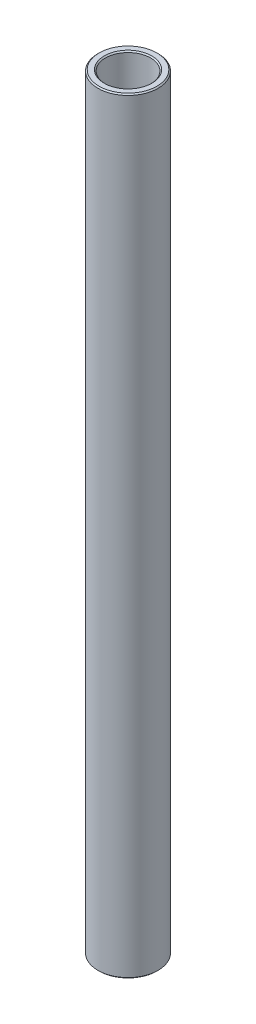
ISO-10303-21;
HEADER;
FILE_DESCRIPTION(('STEP AP214'),'2;1');
FILE_NAME('part.step','',(''),(''),'','','');
FILE_SCHEMA(('AUTOMOTIVE_DESIGN { 1 0 10303 214 1 1 1 1 }'));
ENDSEC;
DATA;
#1=APPLICATION_CONTEXT('core data for automotive mechanical design processes');
#2=APPLICATION_PROTOCOL_DEFINITION('international standard','automotive_design',2000,#1);
#3=PRODUCT_CONTEXT('',#1,'mechanical');
#4=PRODUCT('Part','Part','',(#3));
#5=PRODUCT_RELATED_PRODUCT_CATEGORY('part','',(#4));
#6=PRODUCT_DEFINITION_FORMATION('','',#4);
#7=PRODUCT_DEFINITION_CONTEXT('part definition',#1,'design');
#8=PRODUCT_DEFINITION('design','',#6,#7);
#9=PRODUCT_DEFINITION_SHAPE('','',#8);
#10=(LENGTH_UNIT() NAMED_UNIT(*) SI_UNIT(.MILLI.,.METRE.));
#11=(NAMED_UNIT(*) PLANE_ANGLE_UNIT() SI_UNIT($,.RADIAN.));
#12=(NAMED_UNIT(*) SI_UNIT($,.STERADIAN.) SOLID_ANGLE_UNIT());
#13=UNCERTAINTY_MEASURE_WITH_UNIT(LENGTH_MEASURE(1.E-05),#10,'distance_accuracy_value','');
#14=(GEOMETRIC_REPRESENTATION_CONTEXT(3) GLOBAL_UNCERTAINTY_ASSIGNED_CONTEXT((#13)) GLOBAL_UNIT_ASSIGNED_CONTEXT((#10,
#11,#12)) REPRESENTATION_CONTEXT('',''));
#15=CARTESIAN_POINT('',(0.,0.,0.));
#16=DIRECTION('',(0.,0.,1.));
#17=DIRECTION('',(1.,0.,0.));
#18=AXIS2_PLACEMENT_3D('',#15,#16,#17);
#19=CARTESIAN_POINT('',(6.3500000000003,70.6436949648141,0.));
#20=DIRECTION('',(0.,-1.,0.));
#21=DIRECTION('',(1.,0.,0.));
#22=AXIS2_PLACEMENT_3D('',#19,#20,#21);
#23=PLANE('',#22);
#24=CARTESIAN_POINT('',(1.6889982990843E-13,70.6436949648142,0.));
#25=DIRECTION('',(0.,-1.,0.));
#26=DIRECTION('',(1.,0.,0.));
#27=AXIS2_PLACEMENT_3D('',#24,#25,#26);
#28=CIRCLE('',#27,5.01649999999979);
#29=CARTESIAN_POINT('',(5.01649999999996,70.6436949648141,0.));
#30=VERTEX_POINT('',#29);
#31=EDGE_CURVE('E10',#30,#30,#28,.F.);
#32=ORIENTED_EDGE('',*,*,#31,.T.);
#33=EDGE_LOOP('',(#32));
#34=FACE_BOUND('',#33,.T.);
#35=CARTESIAN_POINT('',(1.6889982990843E-13,70.6436949648142,0.));
#36=DIRECTION('',(0.,-1.,0.));
#37=DIRECTION('',(1.,0.,0.));
#38=AXIS2_PLACEMENT_3D('',#35,#36,#37);
#39=CIRCLE('',#38,6.09600000000013);
#40=CARTESIAN_POINT('',(6.0960000000003,70.6436949648141,0.));
#41=VERTEX_POINT('',#40);
#42=EDGE_CURVE('E38',#41,#41,#39,.T.);
#43=ORIENTED_EDGE('',*,*,#42,.T.);
#44=EDGE_LOOP('',(#43));
#45=FACE_BOUND('',#44,.T.);
#46=ADVANCED_FACE('F31',(#34,#45),#23,.T.);
#47=CARTESIAN_POINT('',(0.,61.1186949648141,0.));
#48=DIRECTION('',(0.,-1.,0.));
#49=DIRECTION('',(1.,0.,0.));
#50=AXIS2_PLACEMENT_3D('',#47,#48,#49);
#51=CYLINDRICAL_SURFACE('',#50,4.76249999999841);
#52=CARTESIAN_POINT('',(3.03236515823251E-12,232.127026635866,0.));
#53=DIRECTION('',(0.,1.,0.));
#54=DIRECTION('',(-1.,0.,0.));
#55=AXIS2_PLACEMENT_3D('',#52,#53,#54);
#56=CIRCLE('',#55,4.76249999999841);
#57=CARTESIAN_POINT('',(-4.76249999999538,232.127026635866,0.));
#58=VERTEX_POINT('',#57);
#59=EDGE_CURVE('E42',#58,#58,#56,.T.);
#60=ORIENTED_EDGE('',*,*,#59,.T.);
#61=EDGE_LOOP('',(#60));
#62=FACE_BOUND('',#61,.T.);
#63=CARTESIAN_POINT('',(1.73403825372679E-13,70.8976949648156,0.));
#64=DIRECTION('',(0.,-1.,0.));
#65=DIRECTION('',(1.,0.,0.));
#66=AXIS2_PLACEMENT_3D('',#63,#64,#65);
#67=CIRCLE('',#66,4.76249999999841);
#68=CARTESIAN_POINT('',(4.76249999999858,70.8976949648155,0.));
#69=VERTEX_POINT('',#68);
#70=EDGE_CURVE('E46',#69,#69,#67,.T.);
#71=ORIENTED_EDGE('',*,*,#70,.T.);
#72=EDGE_LOOP('',(#71));
#73=FACE_BOUND('',#72,.T.);
#74=ADVANCED_FACE('F75',(#62,#73),#51,.F.);
#75=CARTESIAN_POINT('',(4.76250000000001,232.381026635865,0.));
#76=DIRECTION('',(0.,1.,0.));
#77=DIRECTION('',(-1.,0.,0.));
#78=AXIS2_PLACEMENT_3D('',#75,#76,#77);
#79=PLANE('',#78);
#80=CARTESIAN_POINT('',(3.03686915369671E-12,232.381026635865,0.));
#81=DIRECTION('',(0.,1.,0.));
#82=DIRECTION('',(-1.,0.,0.));
#83=AXIS2_PLACEMENT_3D('',#80,#81,#82);
#84=CIRCLE('',#83,6.09599999999719);
#85=CARTESIAN_POINT('',(-6.09599999999416,232.381026635865,0.));
#86=VERTEX_POINT('',#85);
#87=EDGE_CURVE('E51',#86,#86,#84,.T.);
#88=ORIENTED_EDGE('',*,*,#87,.T.);
#89=EDGE_LOOP('',(#88));
#90=FACE_BOUND('',#89,.T.);
#91=CARTESIAN_POINT('',(3.03686915369671E-12,232.381026635865,0.));
#92=DIRECTION('',(0.,1.,0.));
#93=DIRECTION('',(-1.,0.,0.));
#94=AXIS2_PLACEMENT_3D('',#91,#92,#93);
#95=CIRCLE('',#94,5.01649999999698);
#96=CARTESIAN_POINT('',(-5.01649999999394,232.381026635865,0.));
#97=VERTEX_POINT('',#96);
#98=EDGE_CURVE('E54',#97,#97,#95,.F.);
#99=ORIENTED_EDGE('',*,*,#98,.T.);
#100=EDGE_LOOP('',(#99));
#101=FACE_BOUND('',#100,.T.);
#102=ADVANCED_FACE('F80',(#90,#101),#79,.T.);
#103=CARTESIAN_POINT('',(0.,61.1186949648141,0.));
#104=DIRECTION('',(0.,-1.,0.));
#105=DIRECTION('',(1.,0.,0.));
#106=AXIS2_PLACEMENT_3D('',#103,#104,#105);
#107=CYLINDRICAL_SURFACE('',#106,6.34999999999869);
#108=CARTESIAN_POINT('',(3.03236515823246E-12,232.127026635863,0.));
#109=DIRECTION('',(0.,1.,0.));
#110=DIRECTION('',(-1.,0.,0.));
#111=AXIS2_PLACEMENT_3D('',#108,#109,#110);
#112=CIRCLE('',#111,6.34999999999869);
#113=CARTESIAN_POINT('',(-6.34999999999565,232.127026635863,0.));
#114=VERTEX_POINT('',#113);
#115=EDGE_CURVE('E57',#114,#114,#112,.F.);
#116=ORIENTED_EDGE('',*,*,#115,.T.);
#117=EDGE_LOOP('',(#116));
#118=FACE_BOUND('',#117,.T.);
#119=CARTESIAN_POINT('',(1.73403825372629E-13,70.8976949648128,0.));
#120=DIRECTION('',(0.,-1.,0.));
#121=DIRECTION('',(1.,0.,0.));
#122=AXIS2_PLACEMENT_3D('',#119,#120,#121);
#123=CIRCLE('',#122,6.34999999999869);
#124=CARTESIAN_POINT('',(6.34999999999886,70.8976949648127,0.));
#125=VERTEX_POINT('',#124);
#126=EDGE_CURVE('E60',#125,#125,#123,.F.);
#127=ORIENTED_EDGE('',*,*,#126,.T.);
#128=EDGE_LOOP('',(#127));
#129=FACE_BOUND('',#128,.T.);
#130=ADVANCED_FACE('F64',(#118,#129),#107,.T.);
#131=CARTESIAN_POINT('',(3.03236515823246E-12,232.127026635863,0.));
#132=DIRECTION('',(0.,-1.,0.));
#133=DIRECTION('',(1.,0.,0.));
#134=AXIS2_PLACEMENT_3D('',#131,#132,#133);
#135=CONICAL_SURFACE('',#134,6.34999999999869,0.785398163397481);
#136=ORIENTED_EDGE('',*,*,#87,.F.);
#137=EDGE_LOOP('',(#136));
#138=FACE_BOUND('',#137,.T.);
#139=ORIENTED_EDGE('',*,*,#115,.F.);
#140=EDGE_LOOP('',(#139));
#141=FACE_BOUND('',#140,.T.);
#142=ADVANCED_FACE('F85',(#138,#141),#135,.T.);
#143=CARTESIAN_POINT('',(3.03686915369671E-12,232.381026635865,0.));
#144=DIRECTION('',(0.,1.,0.));
#145=DIRECTION('',(-1.,0.,0.));
#146=AXIS2_PLACEMENT_3D('',#143,#144,#145);
#147=CONICAL_SURFACE('',#146,5.01649999999698,0.785398163397406);
#148=ORIENTED_EDGE('',*,*,#59,.F.);
#149=EDGE_LOOP('',(#148));
#150=FACE_BOUND('',#149,.T.);
#151=ORIENTED_EDGE('',*,*,#98,.F.);
#152=EDGE_LOOP('',(#151));
#153=FACE_BOUND('',#152,.T.);
#154=ADVANCED_FACE('F72',(#150,#153),#147,.F.);
#155=CARTESIAN_POINT('',(1.73403825372679E-13,70.8976949648156,0.));
#156=DIRECTION('',(0.,-1.,0.));
#157=DIRECTION('',(1.,0.,0.));
#158=AXIS2_PLACEMENT_3D('',#155,#156,#157);
#159=CONICAL_SURFACE('',#158,4.76249999999841,0.785398163397399);
#160=ORIENTED_EDGE('',*,*,#31,.F.);
#161=EDGE_LOOP('',(#160));
#162=FACE_BOUND('',#161,.T.);
#163=ORIENTED_EDGE('',*,*,#70,.F.);
#164=EDGE_LOOP('',(#163));
#165=FACE_BOUND('',#164,.T.);
#166=ADVANCED_FACE('F68',(#162,#165),#159,.F.);
#167=CARTESIAN_POINT('',(1.6889982990843E-13,70.6436949648142,0.));
#168=DIRECTION('',(0.,1.,0.));
#169=DIRECTION('',(-1.,0.,0.));
#170=AXIS2_PLACEMENT_3D('',#167,#168,#169);
#171=CONICAL_SURFACE('',#170,6.09600000000013,0.785398163397418);
#172=ORIENTED_EDGE('',*,*,#126,.F.);
#173=EDGE_LOOP('',(#172));
#174=FACE_BOUND('',#173,.T.);
#175=ORIENTED_EDGE('',*,*,#42,.F.);
#176=EDGE_LOOP('',(#175));
#177=FACE_BOUND('',#176,.T.);
#178=ADVANCED_FACE('F33',(#174,#177),#171,.T.);
#179=CLOSED_SHELL('',(#46,#74,#102,#130,#142,#154,#166,#178));
#180=MANIFOLD_SOLID_BREP('B2',#179);
#181=ADVANCED_BREP_SHAPE_REPRESENTATION('',(#18,#180),#14);
#182=SHAPE_DEFINITION_REPRESENTATION(#9,#181);
ENDSEC;
END-ISO-10303-21;
